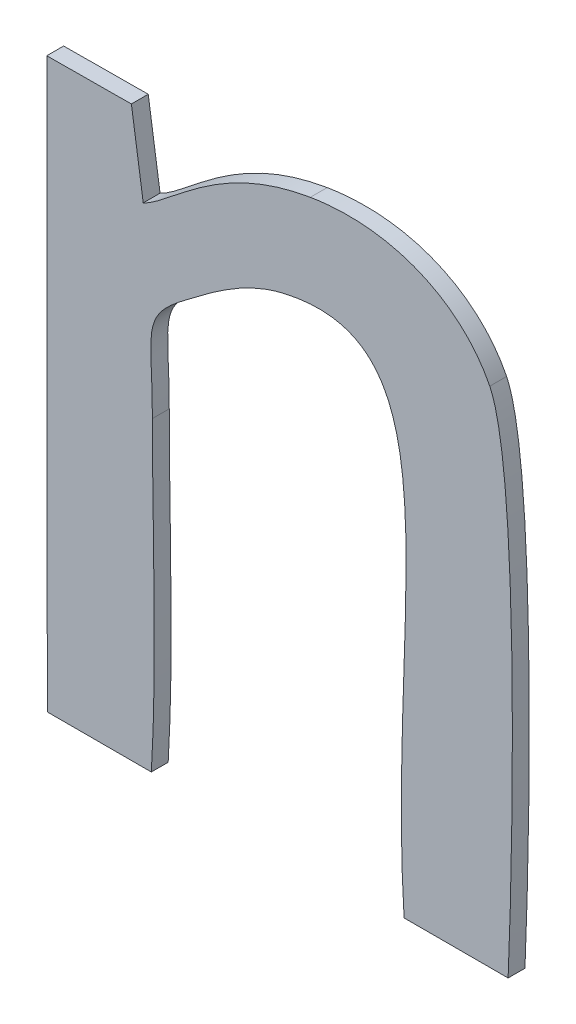
ISO-10303-21;
HEADER;
FILE_DESCRIPTION(('STEP AP214'),'2;1');
FILE_NAME('part.step','',(''),(''),'','','');
FILE_SCHEMA(('AUTOMOTIVE_DESIGN { 1 0 10303 214 1 1 1 1 }'));
ENDSEC;
DATA;
#1=APPLICATION_CONTEXT('core data for automotive mechanical design processes');
#2=APPLICATION_PROTOCOL_DEFINITION('international standard','automotive_design',2000,#1);
#3=PRODUCT_CONTEXT('',#1,'mechanical');
#4=PRODUCT('Part','Part','',(#3));
#5=PRODUCT_RELATED_PRODUCT_CATEGORY('part','',(#4));
#6=PRODUCT_DEFINITION_FORMATION('','',#4);
#7=PRODUCT_DEFINITION_CONTEXT('part definition',#1,'design');
#8=PRODUCT_DEFINITION('design','',#6,#7);
#9=PRODUCT_DEFINITION_SHAPE('','',#8);
#10=(LENGTH_UNIT() NAMED_UNIT(*) SI_UNIT(.MILLI.,.METRE.));
#11=(NAMED_UNIT(*) PLANE_ANGLE_UNIT() SI_UNIT($,.RADIAN.));
#12=(NAMED_UNIT(*) SI_UNIT($,.STERADIAN.) SOLID_ANGLE_UNIT());
#13=UNCERTAINTY_MEASURE_WITH_UNIT(LENGTH_MEASURE(1.E-05),#10,'distance_accuracy_value','');
#14=(GEOMETRIC_REPRESENTATION_CONTEXT(3) GLOBAL_UNCERTAINTY_ASSIGNED_CONTEXT((#13)) GLOBAL_UNIT_ASSIGNED_CONTEXT((#10,
#11,#12)) REPRESENTATION_CONTEXT('',''));
#15=CARTESIAN_POINT('',(0.,0.,0.));
#16=DIRECTION('',(0.,0.,1.));
#17=DIRECTION('',(1.,0.,0.));
#18=AXIS2_PLACEMENT_3D('',#15,#16,#17);
#19=CARTESIAN_POINT('',(-1.9413512109375,-48.6085785546875,0.001));
#20=CARTESIAN_POINT('',(-1.9413512109375,-48.6085785546875,0.));
#21=CARTESIAN_POINT('',(-1.9429828125,-48.6053153515625,0.001));
#22=CARTESIAN_POINT('',(-1.9429828125,-48.6053153515625,0.));
#23=CARTESIAN_POINT('',(-1.9469818359375,-48.603363828125,0.001));
#24=CARTESIAN_POINT('',(-1.9469818359375,-48.603363828125,0.));
#25=CARTESIAN_POINT('',(-1.952004609375,-48.604195625,0.001));
#26=CARTESIAN_POINT('',(-1.952004609375,-48.604195625,0.));
#27=B_SPLINE_SURFACE_WITH_KNOTS('',3,1,((#19,#20),(#21,#22),(#23,#24),(#25,#26)),.UNSPECIFIED.,
.F.,.F.,.F.,(4,4),(2,2),(0.461538461538462,0.538461538461538),(0.,1.),.UNSPECIFIED.);
#28=CARTESIAN_POINT('',(-1.9413512109375,-48.6085785546875,0.));
#29=CARTESIAN_POINT('',(-1.9429828125,-48.6053153515625,0.));
#30=CARTESIAN_POINT('',(-1.9469818359375,-48.603363828125,0.));
#31=CARTESIAN_POINT('',(-1.952004609375,-48.604195625,0.));
#32=B_SPLINE_CURVE_WITH_KNOTS('',3,(#28,#29,#30,#31),.UNSPECIFIED.,.F.,.F.,(4,4),
(0.461538461538462,0.538461538461538),.UNSPECIFIED.);
#33=CARTESIAN_POINT('',(-1.9413512109375,-48.6085785546875,0.));
#34=VERTEX_POINT('',#33);
#35=CARTESIAN_POINT('',(-1.952004609375,-48.604195625,0.));
#36=VERTEX_POINT('',#35);
#37=EDGE_CURVE('E11',#34,#36,#32,.T.);
#38=DIRECTION('',(0.,0.,-1.));
#39=VECTOR('',#38,1.);
#40=CARTESIAN_POINT('',(-1.952004609375,-48.604195625,0.001));
#41=LINE('',#40,#39);
#42=CARTESIAN_POINT('',(-1.952004609375,-48.604195625,0.001));
#43=VERTEX_POINT('',#42);
#44=EDGE_CURVE('E28',#43,#36,#41,.T.);
#45=CARTESIAN_POINT('',(-1.9413512109375,-48.6085785546875,0.001));
#46=CARTESIAN_POINT('',(-1.9429828125,-48.6053153515625,0.001));
#47=CARTESIAN_POINT('',(-1.9469818359375,-48.603363828125,0.001));
#48=CARTESIAN_POINT('',(-1.952004609375,-48.604195625,0.001));
#49=B_SPLINE_CURVE_WITH_KNOTS('',3,(#45,#46,#47,#48),.UNSPECIFIED.,.F.,.F.,(4,4),
(0.461538461538462,0.538461538461538),.UNSPECIFIED.);
#50=CARTESIAN_POINT('',(-1.9413512109375,-48.6085785546875,0.001));
#51=VERTEX_POINT('',#50);
#52=EDGE_CURVE('E260',#51,#43,#49,.T.);
#53=DIRECTION('',(0.,0.,-1.));
#54=VECTOR('',#53,1.);
#55=CARTESIAN_POINT('',(-1.9413512109375,-48.6085785546875,0.001));
#56=LINE('',#55,#54);
#57=EDGE_CURVE('E40',#51,#34,#56,.T.);
#58=ORIENTED_EDGE('',*,*,#37,.T.);
#59=ORIENTED_EDGE('',*,*,#44,.F.);
#60=ORIENTED_EDGE('',*,*,#52,.F.);
#61=ORIENTED_EDGE('',*,*,#57,.T.);
#62=EDGE_LOOP('',(#58,#59,#60,#61));
#63=FACE_BOUND('',#62,.T.);
#64=ADVANCED_FACE('F17',(#63),#27,.F.);
#65=CARTESIAN_POINT('',(-1.952004609375,-48.604195625,0.000999999999999998));
#66=CARTESIAN_POINT('',(-1.952004609375,-48.604195625,0.));
#67=CARTESIAN_POINT('',(-1.95757125,-48.6051233984375,0.000999999999999998));
#68=CARTESIAN_POINT('',(-1.95757125,-48.6051233984375,0.));
#69=CARTESIAN_POINT('',(-1.960194609375,-48.6086425390625,0.000999999999999998));
#70=CARTESIAN_POINT('',(-1.960194609375,-48.6086425390625,0.));
#71=CARTESIAN_POINT('',(-1.9619221875,-48.60944234375,0.000999999999999998));
#72=CARTESIAN_POINT('',(-1.9619221875,-48.60944234375,0.));
#73=B_SPLINE_SURFACE_WITH_KNOTS('',3,1,((#65,#66),(#67,#68),(#69,#70),(#71,#72)),.UNSPECIFIED.,
.F.,.F.,.F.,(4,4),(2,2),(0.538461538461538,0.615384615384615),(0.,1.),.UNSPECIFIED.);
#74=CARTESIAN_POINT('',(-1.952004609375,-48.604195625,0.));
#75=CARTESIAN_POINT('',(-1.95757125,-48.6051233984375,0.));
#76=CARTESIAN_POINT('',(-1.960194609375,-48.6086425390625,0.));
#77=CARTESIAN_POINT('',(-1.9619221875,-48.60944234375,0.));
#78=B_SPLINE_CURVE_WITH_KNOTS('',3,(#74,#75,#76,#77),.UNSPECIFIED.,.F.,.F.,(4,4),
(0.538461538461538,0.615384615384615),.UNSPECIFIED.);
#79=CARTESIAN_POINT('',(-1.9619221875,-48.60944234375,0.));
#80=VERTEX_POINT('',#79);
#81=EDGE_CURVE('E252',#36,#80,#78,.T.);
#82=DIRECTION('',(0.,0.,-1.));
#83=VECTOR('',#82,1.);
#84=CARTESIAN_POINT('',(-1.9619221875,-48.60944234375,0.001));
#85=LINE('',#84,#83);
#86=CARTESIAN_POINT('',(-1.9619221875,-48.60944234375,0.001));
#87=VERTEX_POINT('',#86);
#88=EDGE_CURVE('E247',#87,#80,#85,.T.);
#89=CARTESIAN_POINT('',(-1.952004609375,-48.604195625,0.001));
#90=CARTESIAN_POINT('',(-1.95757125,-48.6051233984375,0.000999999999999998));
#91=CARTESIAN_POINT('',(-1.960194609375,-48.6086425390625,0.000999999999999998));
#92=CARTESIAN_POINT('',(-1.9619221875,-48.60944234375,0.001));
#93=B_SPLINE_CURVE_WITH_KNOTS('',3,(#89,#90,#91,#92),.UNSPECIFIED.,.F.,.F.,(4,4),
(0.538461538461538,0.615384615384615),.UNSPECIFIED.);
#94=EDGE_CURVE('E243',#43,#87,#93,.T.);
#95=ORIENTED_EDGE('',*,*,#81,.T.);
#96=ORIENTED_EDGE('',*,*,#88,.F.);
#97=ORIENTED_EDGE('',*,*,#94,.F.);
#98=ORIENTED_EDGE('',*,*,#44,.T.);
#99=EDGE_LOOP('',(#95,#96,#97,#98));
#100=FACE_BOUND('',#99,.T.);
#101=ADVANCED_FACE('F268',(#100),#73,.F.);
#102=CARTESIAN_POINT('',(-8.9890248287525,-1.336206393462,0.001));
#103=DIRECTION('',(-0.98913157652733,-0.147033072186358,0.));
#104=DIRECTION('',(0.147033072186358,-0.98913157652733,0.));
#105=AXIS2_PLACEMENT_3D('',#102,#103,#104);
#106=PLANE('',#105);
#107=DIRECTION('',(-0.147033072186358,0.98913157652733,0.));
#108=VECTOR('',#107,1.);
#109=CARTESIAN_POINT('',(-8.9890248287525,-1.336206393462,0.));
#110=LINE('',#109,#108);
#111=CARTESIAN_POINT('',(-1.962626015625,-48.6047075,0.));
#112=VERTEX_POINT('',#111);
#113=EDGE_CURVE('E241',#80,#112,#110,.T.);
#114=ORIENTED_EDGE('',*,*,#113,.T.);
#115=DIRECTION('',(0.,0.,-1.));
#116=VECTOR('',#115,1.);
#117=CARTESIAN_POINT('',(-1.962626015625,-48.6047075,0.001));
#118=LINE('',#117,#116);
#119=CARTESIAN_POINT('',(-1.962626015625,-48.6047075,0.001));
#120=VERTEX_POINT('',#119);
#121=EDGE_CURVE('E238',#120,#112,#118,.T.);
#122=ORIENTED_EDGE('',*,*,#121,.F.);
#123=DIRECTION('',(-0.147033072186358,0.98913157652733,0.));
#124=VECTOR('',#123,1.);
#125=CARTESIAN_POINT('',(-8.9890248287525,-1.336206393462,0.001));
#126=LINE('',#125,#124);
#127=EDGE_CURVE('E235',#87,#120,#126,.T.);
#128=ORIENTED_EDGE('',*,*,#127,.F.);
#129=ORIENTED_EDGE('',*,*,#88,.T.);
#130=EDGE_LOOP('',(#114,#122,#128,#129));
#131=FACE_BOUND('',#130,.T.);
#132=ADVANCED_FACE('F272',(#131),#106,.F.);
#133=CARTESIAN_POINT('',(0.309491945258543,-48.5902354110788,0.001));
#134=DIRECTION('',(0.0063692975522655,-0.999979715818621,0.));
#135=DIRECTION('',(0.999979715818621,0.0063692975522655,0.));
#136=AXIS2_PLACEMENT_3D('',#133,#134,#135);
#137=PLANE('',#136);
#138=DIRECTION('',(-0.999979715818621,-0.0063692975522655,0.));
#139=VECTOR('',#138,1.);
#140=CARTESIAN_POINT('',(0.309491945258543,-48.5902354110788,0.));
#141=LINE('',#140,#139);
#142=CARTESIAN_POINT('',(-1.9676487890625,-48.6047394921875,0.));
#143=VERTEX_POINT('',#142);
#144=EDGE_CURVE('E233',#112,#143,#141,.T.);
#145=ORIENTED_EDGE('',*,*,#144,.T.);
#146=DIRECTION('',(0.,0.,-1.));
#147=VECTOR('',#146,1.);
#148=CARTESIAN_POINT('',(-1.9676487890625,-48.6047394921875,0.001));
#149=LINE('',#148,#147);
#150=CARTESIAN_POINT('',(-1.9676487890625,-48.6047394921875,0.001));
#151=VERTEX_POINT('',#150);
#152=EDGE_CURVE('E230',#151,#143,#149,.T.);
#153=ORIENTED_EDGE('',*,*,#152,.F.);
#154=DIRECTION('',(-0.999979715818621,-0.0063692975522655,0.));
#155=VECTOR('',#154,1.);
#156=CARTESIAN_POINT('',(0.309491945258543,-48.5902354110788,0.001));
#157=LINE('',#156,#155);
#158=EDGE_CURVE('E227',#120,#151,#157,.T.);
#159=ORIENTED_EDGE('',*,*,#158,.F.);
#160=ORIENTED_EDGE('',*,*,#121,.T.);
#161=EDGE_LOOP('',(#145,#153,#159,#160));
#162=FACE_BOUND('',#161,.T.);
#163=ADVANCED_FACE('F276',(#162),#137,.F.);
#164=CARTESIAN_POINT('',(-2.0137615299565,-0.0019105896868567,0.001));
#165=DIRECTION('',(0.99999954992127,0.000948766176391401,0.));
#166=DIRECTION('',(-0.000948766176391401,0.99999954992127,0.));
#167=AXIS2_PLACEMENT_3D('',#164,#165,#166);
#168=PLANE('',#167);
#169=DIRECTION('',(0.000948766176391401,-0.99999954992127,0.));
#170=VECTOR('',#169,1.);
#171=CARTESIAN_POINT('',(-2.0137615299565,-0.0019105896868567,0.));
#172=LINE('',#171,#170);
#173=CARTESIAN_POINT('',(-1.967616796875,-48.6384592578125,0.));
#174=VERTEX_POINT('',#173);
#175=EDGE_CURVE('E225',#143,#174,#172,.T.);
#176=ORIENTED_EDGE('',*,*,#175,.T.);
#177=DIRECTION('',(0.,0.,-1.));
#178=VECTOR('',#177,1.);
#179=CARTESIAN_POINT('',(-1.967616796875,-48.6384592578125,0.001));
#180=LINE('',#179,#178);
#181=CARTESIAN_POINT('',(-1.967616796875,-48.6384592578125,0.001));
#182=VERTEX_POINT('',#181);
#183=EDGE_CURVE('E222',#182,#174,#180,.T.);
#184=ORIENTED_EDGE('',*,*,#183,.F.);
#185=DIRECTION('',(0.000948766176391401,-0.99999954992127,0.));
#186=VECTOR('',#185,1.);
#187=CARTESIAN_POINT('',(-2.0137615299565,-0.0019105896868567,0.001));
#188=LINE('',#187,#186);
#189=EDGE_CURVE('E219',#151,#182,#188,.T.);
#190=ORIENTED_EDGE('',*,*,#189,.F.);
#191=ORIENTED_EDGE('',*,*,#152,.T.);
#192=EDGE_LOOP('',(#176,#184,#190,#191));
#193=FACE_BOUND('',#192,.T.);
#194=ADVANCED_FACE('F280',(#193),#168,.F.);
#195=CARTESIAN_POINT('',(0.,-48.6384592578125,0.001));
#196=DIRECTION('',(0.,1.,0.));
#197=DIRECTION('',(0.,0.,1.));
#198=AXIS2_PLACEMENT_3D('',#195,#196,#197);
#199=PLANE('',#198);
#200=DIRECTION('',(1.,0.,0.));
#201=VECTOR('',#200,1.);
#202=CARTESIAN_POINT('',(0.,-48.6384592578125,0.));
#203=LINE('',#202,#201);
#204=CARTESIAN_POINT('',(-1.9614423046875,-48.6384592578125,0.));
#205=VERTEX_POINT('',#204);
#206=EDGE_CURVE('E217',#174,#205,#203,.T.);
#207=ORIENTED_EDGE('',*,*,#206,.T.);
#208=DIRECTION('',(0.,0.,-1.));
#209=VECTOR('',#208,1.);
#210=CARTESIAN_POINT('',(-1.9614423046875,-48.6384592578125,0.001));
#211=LINE('',#210,#209);
#212=CARTESIAN_POINT('',(-1.9614423046875,-48.6384592578125,0.001));
#213=VERTEX_POINT('',#212);
#214=EDGE_CURVE('E214',#213,#205,#211,.T.);
#215=ORIENTED_EDGE('',*,*,#214,.F.);
#216=DIRECTION('',(1.,0.,0.));
#217=VECTOR('',#216,1.);
#218=CARTESIAN_POINT('',(0.,-48.6384592578125,0.001));
#219=LINE('',#218,#217);
#220=EDGE_CURVE('E208',#182,#213,#219,.T.);
#221=ORIENTED_EDGE('',*,*,#220,.F.);
#222=ORIENTED_EDGE('',*,*,#183,.T.);
#223=EDGE_LOOP('',(#207,#215,#221,#222));
#224=FACE_BOUND('',#223,.T.);
#225=ADVANCED_FACE('F287',(#224),#199,.F.);
#226=CARTESIAN_POINT('',(-1.9614423046875,-48.6384592578125,0.001));
#227=CARTESIAN_POINT('',(-1.9614423046875,-48.6384592578125,0.));
#228=CARTESIAN_POINT('',(-1.961090390625,-48.6327646484375,0.001));
#229=CARTESIAN_POINT('',(-1.961090390625,-48.6327646484375,0.));
#230=CARTESIAN_POINT('',(-1.9613783203125,-48.62607828125,0.001));
#231=CARTESIAN_POINT('',(-1.9613783203125,-48.62607828125,0.));
#232=CARTESIAN_POINT('',(-1.9613783203125,-48.620255703125,0.001));
#233=CARTESIAN_POINT('',(-1.9613783203125,-48.620255703125,0.));
#234=B_SPLINE_SURFACE_WITH_KNOTS('',3,1,((#226,#227),(#228,#229),(#230,#231),(#232,#233)),
.UNSPECIFIED.,.F.,.F.,.F.,(4,4),(2,2),(0.,0.0769230769230769),(0.,1.),.UNSPECIFIED.);
#235=CARTESIAN_POINT('',(-1.9614423046875,-48.6384592578125,0.));
#236=CARTESIAN_POINT('',(-1.961090390625,-48.6327646484375,0.));
#237=CARTESIAN_POINT('',(-1.9613783203125,-48.62607828125,0.));
#238=CARTESIAN_POINT('',(-1.9613783203125,-48.620255703125,0.));
#239=B_SPLINE_CURVE_WITH_KNOTS('',3,(#235,#236,#237,#238),.UNSPECIFIED.,.F.,.F.,(4,4),(0.,
0.0769230769230769),.UNSPECIFIED.);
#240=CARTESIAN_POINT('',(-1.9613783203125,-48.620255703125,0.));
#241=VERTEX_POINT('',#240);
#242=EDGE_CURVE('E203',#205,#241,#239,.T.);
#243=DIRECTION('',(0.,0.,-1.));
#244=VECTOR('',#243,1.);
#245=CARTESIAN_POINT('',(-1.9613783203125,-48.620255703125,0.001));
#246=LINE('',#245,#244);
#247=CARTESIAN_POINT('',(-1.9613783203125,-48.620255703125,0.001));
#248=VERTEX_POINT('',#247);
#249=EDGE_CURVE('E198',#248,#241,#246,.T.);
#250=CARTESIAN_POINT('',(-1.9614423046875,-48.6384592578125,0.001));
#251=CARTESIAN_POINT('',(-1.961090390625,-48.6327646484375,0.001));
#252=CARTESIAN_POINT('',(-1.9613783203125,-48.62607828125,0.001));
#253=CARTESIAN_POINT('',(-1.9613783203125,-48.620255703125,0.001));
#254=B_SPLINE_CURVE_WITH_KNOTS('',3,(#250,#251,#252,#253),.UNSPECIFIED.,.F.,.F.,(4,4),(0.,
0.0769230769230769),.UNSPECIFIED.);
#255=EDGE_CURVE('E191',#213,#248,#254,.T.);
#256=ORIENTED_EDGE('',*,*,#242,.T.);
#257=ORIENTED_EDGE('',*,*,#249,.F.);
#258=ORIENTED_EDGE('',*,*,#255,.F.);
#259=ORIENTED_EDGE('',*,*,#214,.T.);
#260=EDGE_LOOP('',(#256,#257,#258,#259));
#261=FACE_BOUND('',#260,.T.);
#262=ADVANCED_FACE('F291',(#261),#234,.F.);
#263=CARTESIAN_POINT('',(-1.9613783203125,-48.620255703125,0.001));
#264=CARTESIAN_POINT('',(-1.9613783203125,-48.620255703125,0.));
#265=CARTESIAN_POINT('',(-1.9613783203125,-48.6157128125,0.001));
#266=CARTESIAN_POINT('',(-1.9613783203125,-48.6157128125,0.));
#267=CARTESIAN_POINT('',(-1.9621461328125,-48.6152009375,0.001));
#268=CARTESIAN_POINT('',(-1.9621461328125,-48.6152009375,0.));
#269=CARTESIAN_POINT('',(-1.9593308203125,-48.6131214453125,0.001));
#270=CARTESIAN_POINT('',(-1.9593308203125,-48.6131214453125,0.));
#271=B_SPLINE_SURFACE_WITH_KNOTS('',3,1,((#263,#264),(#265,#266),(#267,#268),(#269,#270)),
.UNSPECIFIED.,.F.,.F.,.F.,(4,4),(2,2),(0.0769230769230769,0.153846153846154),(0.,1.),.UNSPECIFIED.);
#272=CARTESIAN_POINT('',(-1.9613783203125,-48.620255703125,0.));
#273=CARTESIAN_POINT('',(-1.9613783203125,-48.6157128125,0.));
#274=CARTESIAN_POINT('',(-1.9621461328125,-48.6152009375,0.));
#275=CARTESIAN_POINT('',(-1.9593308203125,-48.6131214453125,0.));
#276=B_SPLINE_CURVE_WITH_KNOTS('',3,(#272,#273,#274,#275),.UNSPECIFIED.,.F.,.F.,(4,4),
(0.0769230769230769,0.153846153846154),.UNSPECIFIED.);
#277=CARTESIAN_POINT('',(-1.9593308203125,-48.6131214453125,0.));
#278=VERTEX_POINT('',#277);
#279=EDGE_CURVE('E186',#241,#278,#276,.T.);
#280=DIRECTION('',(0.,0.,-1.));
#281=VECTOR('',#280,1.);
#282=CARTESIAN_POINT('',(-1.9593308203125,-48.6131214453125,0.001));
#283=LINE('',#282,#281);
#284=CARTESIAN_POINT('',(-1.9593308203125,-48.6131214453125,0.001));
#285=VERTEX_POINT('',#284);
#286=EDGE_CURVE('E181',#285,#278,#283,.T.);
#287=CARTESIAN_POINT('',(-1.9613783203125,-48.620255703125,0.001));
#288=CARTESIAN_POINT('',(-1.9613783203125,-48.6157128125,0.001));
#289=CARTESIAN_POINT('',(-1.9621461328125,-48.6152009375,0.001));
#290=CARTESIAN_POINT('',(-1.9593308203125,-48.6131214453125,0.001));
#291=B_SPLINE_CURVE_WITH_KNOTS('',3,(#287,#288,#289,#290),.UNSPECIFIED.,.F.,.F.,(4,4),
(0.0769230769230769,0.153846153846154),.UNSPECIFIED.);
#292=EDGE_CURVE('E174',#248,#285,#291,.T.);
#293=ORIENTED_EDGE('',*,*,#279,.T.);
#294=ORIENTED_EDGE('',*,*,#286,.F.);
#295=ORIENTED_EDGE('',*,*,#292,.F.);
#296=ORIENTED_EDGE('',*,*,#249,.T.);
#297=EDGE_LOOP('',(#293,#294,#295,#296));
#298=FACE_BOUND('',#297,.T.);
#299=ADVANCED_FACE('F298',(#298),#271,.F.);
#300=CARTESIAN_POINT('',(-1.9593308203125,-48.6131214453125,0.001));
#301=CARTESIAN_POINT('',(-1.9593308203125,-48.6131214453125,0.));
#302=CARTESIAN_POINT('',(-1.957891171875,-48.6120337109375,0.001));
#303=CARTESIAN_POINT('',(-1.957891171875,-48.6120337109375,0.));
#304=CARTESIAN_POINT('',(-1.9559396484375,-48.61046609375,0.001));
#305=CARTESIAN_POINT('',(-1.9559396484375,-48.61046609375,0.));
#306=CARTESIAN_POINT('',(-1.9535722265625,-48.6099222265625,0.001));
#307=CARTESIAN_POINT('',(-1.9535722265625,-48.6099222265625,0.));
#308=B_SPLINE_SURFACE_WITH_KNOTS('',3,1,((#300,#301),(#302,#303),(#304,#305),(#306,#307)),
.UNSPECIFIED.,.F.,.F.,.F.,(4,4),(2,2),(0.153846153846154,0.230769230769231),(0.,1.),.UNSPECIFIED.);
#309=CARTESIAN_POINT('',(-1.9593308203125,-48.6131214453125,0.));
#310=CARTESIAN_POINT('',(-1.957891171875,-48.6120337109375,0.));
#311=CARTESIAN_POINT('',(-1.9559396484375,-48.61046609375,0.));
#312=CARTESIAN_POINT('',(-1.9535722265625,-48.6099222265625,0.));
#313=B_SPLINE_CURVE_WITH_KNOTS('',3,(#309,#310,#311,#312),.UNSPECIFIED.,.F.,.F.,(4,4),
(0.153846153846154,0.230769230769231),.UNSPECIFIED.);
#314=CARTESIAN_POINT('',(-1.9535722265625,-48.6099222265625,0.));
#315=VERTEX_POINT('',#314);
#316=EDGE_CURVE('E169',#278,#315,#313,.T.);
#317=DIRECTION('',(0.,0.,-1.));
#318=VECTOR('',#317,1.);
#319=CARTESIAN_POINT('',(-1.9535722265625,-48.6099222265625,0.001));
#320=LINE('',#319,#318);
#321=CARTESIAN_POINT('',(-1.9535722265625,-48.6099222265625,0.001));
#322=VERTEX_POINT('',#321);
#323=EDGE_CURVE('E164',#322,#315,#320,.T.);
#324=CARTESIAN_POINT('',(-1.9593308203125,-48.6131214453125,0.001));
#325=CARTESIAN_POINT('',(-1.957891171875,-48.6120337109375,0.001));
#326=CARTESIAN_POINT('',(-1.9559396484375,-48.61046609375,0.001));
#327=CARTESIAN_POINT('',(-1.9535722265625,-48.6099222265625,0.001));
#328=B_SPLINE_CURVE_WITH_KNOTS('',3,(#324,#325,#326,#327),.UNSPECIFIED.,.F.,.F.,(4,4),
(0.153846153846154,0.230769230769231),.UNSPECIFIED.);
#329=EDGE_CURVE('E157',#285,#322,#328,.T.);
#330=ORIENTED_EDGE('',*,*,#316,.T.);
#331=ORIENTED_EDGE('',*,*,#323,.F.);
#332=ORIENTED_EDGE('',*,*,#329,.F.);
#333=ORIENTED_EDGE('',*,*,#286,.T.);
#334=EDGE_LOOP('',(#330,#331,#332,#333));
#335=FACE_BOUND('',#334,.T.);
#336=ADVANCED_FACE('F301',(#335),#308,.F.);
#337=CARTESIAN_POINT('',(-1.9535722265625,-48.6099222265625,0.001));
#338=CARTESIAN_POINT('',(-1.9535722265625,-48.6099222265625,0.));
#339=CARTESIAN_POINT('',(-1.942918828125,-48.6074908203125,0.001));
#340=CARTESIAN_POINT('',(-1.942918828125,-48.6074908203125,0.));
#341=CARTESIAN_POINT('',(-1.94746171875,-48.6225271484375,0.001));
#342=CARTESIAN_POINT('',(-1.94746171875,-48.6225271484375,0.));
#343=CARTESIAN_POINT('',(-1.94643796875,-48.6384592578125,0.001));
#344=CARTESIAN_POINT('',(-1.94643796875,-48.6384592578125,0.));
#345=B_SPLINE_SURFACE_WITH_KNOTS('',3,1,((#337,#338),(#339,#340),(#341,#342),(#343,#344)),
.UNSPECIFIED.,.F.,.F.,.F.,(4,4),(2,2),(0.230769230769231,0.307692307692308),(0.,1.),.UNSPECIFIED.);
#346=CARTESIAN_POINT('',(-1.9535722265625,-48.6099222265625,0.));
#347=CARTESIAN_POINT('',(-1.942918828125,-48.6074908203125,0.));
#348=CARTESIAN_POINT('',(-1.94746171875,-48.6225271484375,0.));
#349=CARTESIAN_POINT('',(-1.94643796875,-48.6384592578125,0.));
#350=B_SPLINE_CURVE_WITH_KNOTS('',3,(#346,#347,#348,#349),.UNSPECIFIED.,.F.,.F.,(4,4),
(0.230769230769231,0.307692307692308),.UNSPECIFIED.);
#351=CARTESIAN_POINT('',(-1.94643796875,-48.6384592578125,0.));
#352=VERTEX_POINT('',#351);
#353=EDGE_CURVE('E152',#315,#352,#350,.T.);
#354=DIRECTION('',(0.,0.,-1.));
#355=VECTOR('',#354,1.);
#356=CARTESIAN_POINT('',(-1.94643796875,-48.6384592578125,0.001));
#357=LINE('',#356,#355);
#358=CARTESIAN_POINT('',(-1.94643796875,-48.6384592578125,0.001));
#359=VERTEX_POINT('',#358);
#360=EDGE_CURVE('E147',#359,#352,#357,.T.);
#361=CARTESIAN_POINT('',(-1.9535722265625,-48.6099222265625,0.001));
#362=CARTESIAN_POINT('',(-1.942918828125,-48.6074908203125,0.001));
#363=CARTESIAN_POINT('',(-1.94746171875,-48.6225271484375,0.001));
#364=CARTESIAN_POINT('',(-1.94643796875,-48.6384592578125,0.001));
#365=B_SPLINE_CURVE_WITH_KNOTS('',3,(#361,#362,#363,#364),.UNSPECIFIED.,.F.,.F.,(4,4),
(0.230769230769231,0.307692307692308),.UNSPECIFIED.);
#366=EDGE_CURVE('E125',#322,#359,#365,.T.);
#367=ORIENTED_EDGE('',*,*,#353,.T.);
#368=ORIENTED_EDGE('',*,*,#360,.F.);
#369=ORIENTED_EDGE('',*,*,#366,.F.);
#370=ORIENTED_EDGE('',*,*,#323,.T.);
#371=EDGE_LOOP('',(#367,#368,#369,#370));
#372=FACE_BOUND('',#371,.T.);
#373=ADVANCED_FACE('F304',(#372),#345,.F.);
#374=CARTESIAN_POINT('',(0.,-48.6384592578125,0.001));
#375=DIRECTION('',(0.,1.,0.));
#376=DIRECTION('',(0.,0.,1.));
#377=AXIS2_PLACEMENT_3D('',#374,#375,#376);
#378=PLANE('',#377);
#379=DIRECTION('',(1.,0.,0.));
#380=VECTOR('',#379,1.);
#381=CARTESIAN_POINT('',(0.,-48.6384592578125,0.));
#382=LINE('',#381,#380);
#383=CARTESIAN_POINT('',(-1.9402634765625,-48.6384592578125,0.));
#384=VERTEX_POINT('',#383);
#385=EDGE_CURVE('E114',#352,#384,#382,.T.);
#386=ORIENTED_EDGE('',*,*,#385,.T.);
#387=DIRECTION('',(0.,0.,-1.));
#388=VECTOR('',#387,1.);
#389=CARTESIAN_POINT('',(-1.9402634765625,-48.6384592578125,0.001));
#390=LINE('',#389,#388);
#391=CARTESIAN_POINT('',(-1.9402634765625,-48.6384592578125,0.001));
#392=VERTEX_POINT('',#391);
#393=EDGE_CURVE('E109',#392,#384,#390,.T.);
#394=ORIENTED_EDGE('',*,*,#393,.F.);
#395=DIRECTION('',(1.,0.,0.));
#396=VECTOR('',#395,1.);
#397=CARTESIAN_POINT('',(0.,-48.6384592578125,0.001));
#398=LINE('',#397,#396);
#399=EDGE_CURVE('E112',#359,#392,#398,.T.);
#400=ORIENTED_EDGE('',*,*,#399,.F.);
#401=ORIENTED_EDGE('',*,*,#360,.T.);
#402=EDGE_LOOP('',(#386,#394,#400,#401));
#403=FACE_BOUND('',#402,.T.);
#404=ADVANCED_FACE('F111',(#403),#378,.F.);
#405=CARTESIAN_POINT('',(-1.9402634765625,-48.6384592578125,0.001));
#406=CARTESIAN_POINT('',(-1.9402634765625,-48.6384592578125,0.));
#407=CARTESIAN_POINT('',(-1.9400075390625,-48.6328926171875,0.001));
#408=CARTESIAN_POINT('',(-1.9400075390625,-48.6328926171875,0.));
#409=CARTESIAN_POINT('',(-1.93952765625,-48.6122896484375,0.001));
#410=CARTESIAN_POINT('',(-1.93952765625,-48.6122896484375,0.));
#411=CARTESIAN_POINT('',(-1.9413512109375,-48.6085785546875,0.001));
#412=CARTESIAN_POINT('',(-1.9413512109375,-48.6085785546875,0.));
#413=B_SPLINE_SURFACE_WITH_KNOTS('',3,1,((#405,#406),(#407,#408),(#409,#410),(#411,#412)),
.UNSPECIFIED.,.F.,.F.,.F.,(4,4),(2,2),(0.384615384615385,0.461538461538462),(0.,1.),.UNSPECIFIED.);
#414=CARTESIAN_POINT('',(-1.9402634765625,-48.6384592578125,0.));
#415=CARTESIAN_POINT('',(-1.9400075390625,-48.6328926171875,0.));
#416=CARTESIAN_POINT('',(-1.93952765625,-48.6122896484375,0.));
#417=CARTESIAN_POINT('',(-1.9413512109375,-48.6085785546875,0.));
#418=B_SPLINE_CURVE_WITH_KNOTS('',3,(#414,#415,#416,#417),.UNSPECIFIED.,.F.,.F.,(4,4),
(0.384615384615385,0.461538461538462),.UNSPECIFIED.);
#419=EDGE_CURVE('E127',#384,#34,#418,.T.);
#420=CARTESIAN_POINT('',(-1.9402634765625,-48.6384592578125,0.001));
#421=CARTESIAN_POINT('',(-1.9400075390625,-48.6328926171875,0.001));
#422=CARTESIAN_POINT('',(-1.93952765625,-48.6122896484375,0.001));
#423=CARTESIAN_POINT('',(-1.9413512109375,-48.6085785546875,0.001));
#424=B_SPLINE_CURVE_WITH_KNOTS('',3,(#420,#421,#422,#423),.UNSPECIFIED.,.F.,.F.,(4,4),
(0.384615384615385,0.461538461538462),.UNSPECIFIED.);
#425=EDGE_CURVE('E123',#392,#51,#424,.T.);
#426=ORIENTED_EDGE('',*,*,#419,.T.);
#427=ORIENTED_EDGE('',*,*,#57,.F.);
#428=ORIENTED_EDGE('',*,*,#425,.F.);
#429=ORIENTED_EDGE('',*,*,#393,.T.);
#430=EDGE_LOOP('',(#426,#427,#428,#429));
#431=FACE_BOUND('',#430,.T.);
#432=ADVANCED_FACE('F129',(#431),#413,.F.);
#433=CARTESIAN_POINT('',(0.,0.,0.001));
#434=DIRECTION('',(0.,0.,1.));
#435=DIRECTION('',(1.,0.,0.));
#436=AXIS2_PLACEMENT_3D('',#433,#434,#435);
#437=PLANE('',#436);
#438=ORIENTED_EDGE('',*,*,#52,.T.);
#439=ORIENTED_EDGE('',*,*,#94,.T.);
#440=ORIENTED_EDGE('',*,*,#127,.T.);
#441=ORIENTED_EDGE('',*,*,#158,.T.);
#442=ORIENTED_EDGE('',*,*,#189,.T.);
#443=ORIENTED_EDGE('',*,*,#220,.T.);
#444=ORIENTED_EDGE('',*,*,#255,.T.);
#445=ORIENTED_EDGE('',*,*,#292,.T.);
#446=ORIENTED_EDGE('',*,*,#329,.T.);
#447=ORIENTED_EDGE('',*,*,#366,.T.);
#448=ORIENTED_EDGE('',*,*,#399,.T.);
#449=ORIENTED_EDGE('',*,*,#425,.T.);
#450=EDGE_LOOP('',(#438,#439,#440,#441,#442,#443,#444,#445,#446,#447,#448,#449));
#451=FACE_BOUND('',#450,.T.);
#452=ADVANCED_FACE('F122',(#451),#437,.T.);
#453=CARTESIAN_POINT('',(0.,0.,0.));
#454=DIRECTION('',(0.,0.,1.));
#455=DIRECTION('',(1.,0.,0.));
#456=AXIS2_PLACEMENT_3D('',#453,#454,#455);
#457=PLANE('',#456);
#458=ORIENTED_EDGE('',*,*,#37,.F.);
#459=ORIENTED_EDGE('',*,*,#419,.F.);
#460=ORIENTED_EDGE('',*,*,#385,.F.);
#461=ORIENTED_EDGE('',*,*,#353,.F.);
#462=ORIENTED_EDGE('',*,*,#316,.F.);
#463=ORIENTED_EDGE('',*,*,#279,.F.);
#464=ORIENTED_EDGE('',*,*,#242,.F.);
#465=ORIENTED_EDGE('',*,*,#206,.F.);
#466=ORIENTED_EDGE('',*,*,#175,.F.);
#467=ORIENTED_EDGE('',*,*,#144,.F.);
#468=ORIENTED_EDGE('',*,*,#113,.F.);
#469=ORIENTED_EDGE('',*,*,#81,.F.);
#470=EDGE_LOOP('',(#458,#459,#460,#461,#462,#463,#464,#465,#466,#467,#468,#469));
#471=FACE_BOUND('',#470,.T.);
#472=ADVANCED_FACE('F283',(#471),#457,.F.);
#473=CLOSED_SHELL('',(#64,#101,#132,#163,#194,#225,#262,#299,#336,#373,#404,#432,#452,#472));
#474=MANIFOLD_SOLID_BREP('B1',#473);
#475=ADVANCED_BREP_SHAPE_REPRESENTATION('',(#18,#474),#14);
#476=SHAPE_DEFINITION_REPRESENTATION(#9,#475);
ENDSEC;
END-ISO-10303-21;
